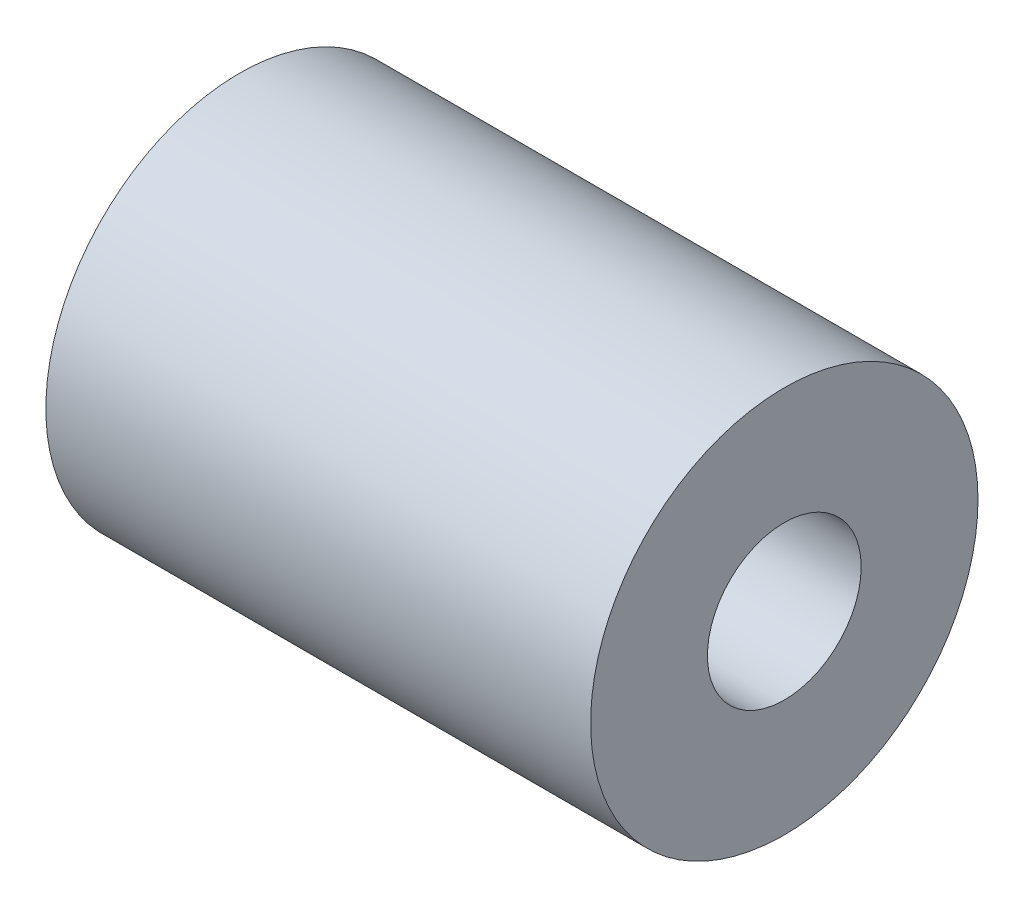
ISO-10303-21;
HEADER;
FILE_DESCRIPTION(('STEP AP214'),'2;1');
FILE_NAME('part.step','',(''),(''),'','','');
FILE_SCHEMA(('AUTOMOTIVE_DESIGN { 1 0 10303 214 1 1 1 1 }'));
ENDSEC;
DATA;
#1=APPLICATION_CONTEXT('core data for automotive mechanical design processes');
#2=APPLICATION_PROTOCOL_DEFINITION('international standard','automotive_design',2000,#1);
#3=PRODUCT_CONTEXT('',#1,'mechanical');
#4=PRODUCT('Part','Part','',(#3));
#5=PRODUCT_RELATED_PRODUCT_CATEGORY('part','',(#4));
#6=PRODUCT_DEFINITION_FORMATION('','',#4);
#7=PRODUCT_DEFINITION_CONTEXT('part definition',#1,'design');
#8=PRODUCT_DEFINITION('design','',#6,#7);
#9=PRODUCT_DEFINITION_SHAPE('','',#8);
#10=(LENGTH_UNIT() NAMED_UNIT(*) SI_UNIT(.MILLI.,.METRE.));
#11=(NAMED_UNIT(*) PLANE_ANGLE_UNIT() SI_UNIT($,.RADIAN.));
#12=(NAMED_UNIT(*) SI_UNIT($,.STERADIAN.) SOLID_ANGLE_UNIT());
#13=UNCERTAINTY_MEASURE_WITH_UNIT(LENGTH_MEASURE(1.E-05),#10,'distance_accuracy_value','');
#14=(GEOMETRIC_REPRESENTATION_CONTEXT(3) GLOBAL_UNCERTAINTY_ASSIGNED_CONTEXT((#13)) GLOBAL_UNIT_ASSIGNED_CONTEXT((#10,
#11,#12)) REPRESENTATION_CONTEXT('',''));
#15=CARTESIAN_POINT('',(0.,0.,0.));
#16=DIRECTION('',(0.,0.,1.));
#17=DIRECTION('',(1.,0.,0.));
#18=AXIS2_PLACEMENT_3D('',#15,#16,#17);
#19=CARTESIAN_POINT('',(11.25,0.,0.));
#20=DIRECTION('',(-1.,0.,0.));
#21=DIRECTION('',(0.,0.,1.));
#22=AXIS2_PLACEMENT_3D('',#19,#20,#21);
#23=CYLINDRICAL_SURFACE('',#22,2.5);
#24=CARTESIAN_POINT('',(-11.25,0.,0.));
#25=DIRECTION('',(1.,0.,0.));
#26=DIRECTION('',(0.,0.,-1.));
#27=AXIS2_PLACEMENT_3D('',#24,#25,#26);
#28=CIRCLE('',#27,2.5);
#29=CARTESIAN_POINT('',(-11.25,0.,-2.5));
#30=VERTEX_POINT('',#29);
#31=EDGE_CURVE('E47',#30,#30,#28,.T.);
#32=ORIENTED_EDGE('',*,*,#31,.F.);
#33=EDGE_LOOP('',(#32));
#34=FACE_BOUND('',#33,.T.);
#35=CARTESIAN_POINT('',(-4.9,0.,0.));
#36=DIRECTION('',(1.,0.,0.));
#37=DIRECTION('',(0.,0.,-1.));
#38=AXIS2_PLACEMENT_3D('',#35,#36,#37);
#39=CIRCLE('',#38,2.5);
#40=CARTESIAN_POINT('',(-4.9,0.,-2.5));
#41=VERTEX_POINT('',#40);
#42=EDGE_CURVE('E54',#41,#41,#39,.T.);
#43=ORIENTED_EDGE('',*,*,#42,.T.);
#44=EDGE_LOOP('',(#43));
#45=FACE_BOUND('',#44,.T.);
#46=ADVANCED_FACE('F34',(#34,#45),#23,.F.);
#47=CARTESIAN_POINT('',(11.25,0.,0.));
#48=DIRECTION('',(1.,0.,0.));
#49=DIRECTION('',(0.,0.,-1.));
#50=AXIS2_PLACEMENT_3D('',#47,#48,#49);
#51=PLANE('',#50);
#52=CARTESIAN_POINT('',(11.25,0.,0.));
#53=DIRECTION('',(1.,0.,0.));
#54=DIRECTION('',(0.,0.,-1.));
#55=AXIS2_PLACEMENT_3D('',#52,#53,#54);
#56=CIRCLE('',#55,3.175);
#57=CARTESIAN_POINT('',(11.25,0.,-3.175));
#58=VERTEX_POINT('',#57);
#59=EDGE_CURVE('E51',#58,#58,#56,.T.);
#60=ORIENTED_EDGE('',*,*,#59,.F.);
#61=EDGE_LOOP('',(#60));
#62=FACE_BOUND('',#61,.T.);
#63=CARTESIAN_POINT('',(11.25,0.,0.));
#64=DIRECTION('',(1.,0.,0.));
#65=DIRECTION('',(0.,0.,-1.));
#66=AXIS2_PLACEMENT_3D('',#63,#64,#65);
#67=CIRCLE('',#66,8.);
#68=CARTESIAN_POINT('',(11.25,0.,-8.));
#69=VERTEX_POINT('',#68);
#70=EDGE_CURVE('E11',#69,#69,#67,.T.);
#71=ORIENTED_EDGE('',*,*,#70,.T.);
#72=EDGE_LOOP('',(#71));
#73=FACE_BOUND('',#72,.T.);
#74=ADVANCED_FACE('F76',(#62,#73),#51,.T.);
#75=CARTESIAN_POINT('',(-11.25,0.,0.));
#76=DIRECTION('',(1.,0.,0.));
#77=DIRECTION('',(0.,0.,-1.));
#78=AXIS2_PLACEMENT_3D('',#75,#76,#77);
#79=PLANE('',#78);
#80=CARTESIAN_POINT('',(-11.25,0.,0.));
#81=DIRECTION('',(1.,0.,0.));
#82=DIRECTION('',(0.,0.,-1.));
#83=AXIS2_PLACEMENT_3D('',#80,#81,#82);
#84=CIRCLE('',#83,8.);
#85=CARTESIAN_POINT('',(-11.25,0.,-8.));
#86=VERTEX_POINT('',#85);
#87=EDGE_CURVE('E42',#86,#86,#84,.T.);
#88=ORIENTED_EDGE('',*,*,#87,.F.);
#89=EDGE_LOOP('',(#88));
#90=FACE_BOUND('',#89,.T.);
#91=ORIENTED_EDGE('',*,*,#31,.T.);
#92=EDGE_LOOP('',(#91));
#93=FACE_BOUND('',#92,.T.);
#94=ADVANCED_FACE('F82',(#90,#93),#79,.F.);
#95=CARTESIAN_POINT('',(11.25,0.,0.));
#96=DIRECTION('',(-1.,0.,0.));
#97=DIRECTION('',(0.,0.,1.));
#98=AXIS2_PLACEMENT_3D('',#95,#96,#97);
#99=CYLINDRICAL_SURFACE('',#98,8.);
#100=ORIENTED_EDGE('',*,*,#70,.F.);
#101=EDGE_LOOP('',(#100));
#102=FACE_BOUND('',#101,.T.);
#103=ORIENTED_EDGE('',*,*,#87,.T.);
#104=EDGE_LOOP('',(#103));
#105=FACE_BOUND('',#104,.T.);
#106=ADVANCED_FACE('F36',(#102,#105),#99,.T.);
#107=CARTESIAN_POINT('',(0.,0.,0.));
#108=DIRECTION('',(1.,0.,0.));
#109=DIRECTION('',(0.,0.,-1.));
#110=AXIS2_PLACEMENT_3D('',#107,#108,#109);
#111=CYLINDRICAL_SURFACE('',#110,3.175);
#112=CARTESIAN_POINT('',(4.9,0.,0.));
#113=DIRECTION('',(1.,0.,0.));
#114=DIRECTION('',(0.,0.,-1.));
#115=AXIS2_PLACEMENT_3D('',#112,#113,#114);
#116=CIRCLE('',#115,3.175);
#117=CARTESIAN_POINT('',(4.9,0.,-3.175));
#118=VERTEX_POINT('',#117);
#119=EDGE_CURVE('E38',#118,#118,#116,.F.);
#120=ORIENTED_EDGE('',*,*,#119,.T.);
#121=EDGE_LOOP('',(#120));
#122=FACE_BOUND('',#121,.T.);
#123=ORIENTED_EDGE('',*,*,#59,.T.);
#124=EDGE_LOOP('',(#123));
#125=FACE_BOUND('',#124,.T.);
#126=ADVANCED_FACE('F61',(#122,#125),#111,.F.);
#127=CARTESIAN_POINT('',(4.9,0.,0.));
#128=DIRECTION('',(1.,0.,0.));
#129=DIRECTION('',(0.,0.,-1.));
#130=AXIS2_PLACEMENT_3D('',#127,#128,#129);
#131=PLANE('',#130);
#132=ORIENTED_EDGE('',*,*,#119,.F.);
#133=EDGE_LOOP('',(#132));
#134=FACE_BOUND('',#133,.T.);
#135=ADVANCED_FACE('F64',(#134),#131,.T.);
#136=CARTESIAN_POINT('',(-4.9,0.,0.));
#137=DIRECTION('',(1.,0.,0.));
#138=DIRECTION('',(0.,0.,-1.));
#139=AXIS2_PLACEMENT_3D('',#136,#137,#138);
#140=PLANE('',#139);
#141=ORIENTED_EDGE('',*,*,#42,.F.);
#142=EDGE_LOOP('',(#141));
#143=FACE_BOUND('',#142,.T.);
#144=ADVANCED_FACE('F66',(#143),#140,.F.);
#145=CLOSED_SHELL('',(#46,#74,#94,#106,#126,#135,#144));
#146=MANIFOLD_SOLID_BREP('B2',#145);
#147=ADVANCED_BREP_SHAPE_REPRESENTATION('',(#18,#146),#14);
#148=SHAPE_DEFINITION_REPRESENTATION(#9,#147);
ENDSEC;
END-ISO-10303-21;
